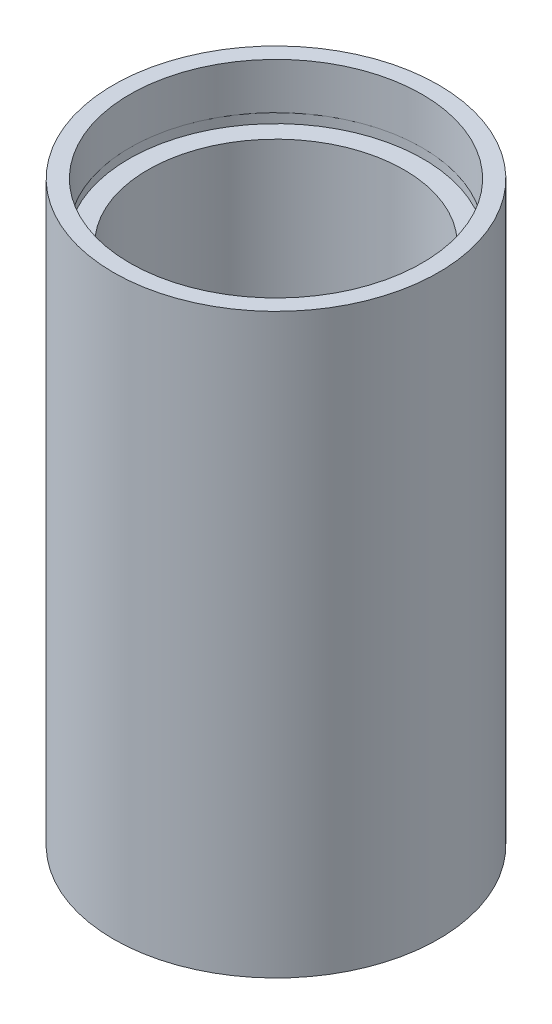
ISO-10303-21;
HEADER;
FILE_DESCRIPTION(('STEP AP214'),'2;1');
FILE_NAME('part.step','',(''),(''),'','','');
FILE_SCHEMA(('AUTOMOTIVE_DESIGN { 1 0 10303 214 1 1 1 1 }'));
ENDSEC;
DATA;
#1=APPLICATION_CONTEXT('core data for automotive mechanical design processes');
#2=APPLICATION_PROTOCOL_DEFINITION('international standard','automotive_design',2000,#1);
#3=PRODUCT_CONTEXT('',#1,'mechanical');
#4=PRODUCT('Part','Part','',(#3));
#5=PRODUCT_RELATED_PRODUCT_CATEGORY('part','',(#4));
#6=PRODUCT_DEFINITION_FORMATION('','',#4);
#7=PRODUCT_DEFINITION_CONTEXT('part definition',#1,'design');
#8=PRODUCT_DEFINITION('design','',#6,#7);
#9=PRODUCT_DEFINITION_SHAPE('','',#8);
#10=(LENGTH_UNIT() NAMED_UNIT(*) SI_UNIT(.MILLI.,.METRE.));
#11=(NAMED_UNIT(*) PLANE_ANGLE_UNIT() SI_UNIT($,.RADIAN.));
#12=(NAMED_UNIT(*) SI_UNIT($,.STERADIAN.) SOLID_ANGLE_UNIT());
#13=UNCERTAINTY_MEASURE_WITH_UNIT(LENGTH_MEASURE(1.E-05),#10,'distance_accuracy_value','');
#14=(GEOMETRIC_REPRESENTATION_CONTEXT(3) GLOBAL_UNCERTAINTY_ASSIGNED_CONTEXT((#13)) GLOBAL_UNIT_ASSIGNED_CONTEXT((#10,
#11,#12)) REPRESENTATION_CONTEXT('',''));
#15=CARTESIAN_POINT('',(0.,0.,0.));
#16=DIRECTION('',(0.,0.,1.));
#17=DIRECTION('',(1.,0.,0.));
#18=AXIS2_PLACEMENT_3D('',#15,#16,#17);
#19=CARTESIAN_POINT('',(13.75,0.,0.));
#20=DIRECTION('',(0.,1.,0.));
#21=DIRECTION('',(0.,0.,1.));
#22=AXIS2_PLACEMENT_3D('',#19,#20,#21);
#23=PLANE('',#22);
#24=CARTESIAN_POINT('',(0.,0.,0.));
#25=DIRECTION('',(0.,1.,0.));
#26=DIRECTION('',(0.,0.,1.));
#27=AXIS2_PLACEMENT_3D('',#24,#25,#26);
#28=CIRCLE('',#27,15.85);
#29=CARTESIAN_POINT('',(0.,0.,15.85));
#30=VERTEX_POINT('',#29);
#31=EDGE_CURVE('E10',#30,#30,#28,.T.);
#32=ORIENTED_EDGE('',*,*,#31,.F.);
#33=EDGE_LOOP('',(#32));
#34=FACE_BOUND('',#33,.T.);
#35=CARTESIAN_POINT('',(0.,0.,0.));
#36=DIRECTION('',(0.,1.,0.));
#37=DIRECTION('',(0.,0.,1.));
#38=AXIS2_PLACEMENT_3D('',#35,#36,#37);
#39=CIRCLE('',#38,13.75);
#40=CARTESIAN_POINT('',(0.,0.,13.75));
#41=VERTEX_POINT('',#40);
#42=EDGE_CURVE('E77',#41,#41,#39,.T.);
#43=ORIENTED_EDGE('',*,*,#42,.T.);
#44=EDGE_LOOP('',(#43));
#45=FACE_BOUND('',#44,.T.);
#46=ADVANCED_FACE('F37',(#34,#45),#23,.F.);
#47=CARTESIAN_POINT('',(0.,161.376166943427,0.));
#48=DIRECTION('',(0.,1.,0.));
#49=DIRECTION('',(0.,0.,1.));
#50=AXIS2_PLACEMENT_3D('',#47,#48,#49);
#51=CYLINDRICAL_SURFACE('',#50,15.85);
#52=CARTESIAN_POINT('',(0.,56.3,0.));
#53=DIRECTION('',(0.,1.,0.));
#54=DIRECTION('',(0.,0.,1.));
#55=AXIS2_PLACEMENT_3D('',#52,#53,#54);
#56=CIRCLE('',#55,15.85);
#57=CARTESIAN_POINT('',(0.,56.3,15.85));
#58=VERTEX_POINT('',#57);
#59=EDGE_CURVE('E43',#58,#58,#56,.T.);
#60=ORIENTED_EDGE('',*,*,#59,.F.);
#61=EDGE_LOOP('',(#60));
#62=FACE_BOUND('',#61,.T.);
#63=ORIENTED_EDGE('',*,*,#31,.T.);
#64=EDGE_LOOP('',(#63));
#65=FACE_BOUND('',#64,.T.);
#66=ADVANCED_FACE('F138',(#62,#65),#51,.T.);
#67=CARTESIAN_POINT('',(15.85,56.3,0.));
#68=DIRECTION('',(0.,-1.,0.));
#69=DIRECTION('',(0.,0.,-1.));
#70=AXIS2_PLACEMENT_3D('',#67,#68,#69);
#71=PLANE('',#70);
#72=CARTESIAN_POINT('',(0.,56.3,0.));
#73=DIRECTION('',(0.,1.,0.));
#74=DIRECTION('',(0.,0.,1.));
#75=AXIS2_PLACEMENT_3D('',#72,#73,#74);
#76=CIRCLE('',#75,14.25);
#77=CARTESIAN_POINT('',(0.,56.3,14.25));
#78=VERTEX_POINT('',#77);
#79=EDGE_CURVE('E47',#78,#78,#76,.T.);
#80=ORIENTED_EDGE('',*,*,#79,.F.);
#81=EDGE_LOOP('',(#80));
#82=FACE_BOUND('',#81,.T.);
#83=ORIENTED_EDGE('',*,*,#59,.T.);
#84=EDGE_LOOP('',(#83));
#85=FACE_BOUND('',#84,.T.);
#86=ADVANCED_FACE('F133',(#82,#85),#71,.F.);
#87=CARTESIAN_POINT('',(0.,161.376166943427,0.));
#88=DIRECTION('',(0.,1.,0.));
#89=DIRECTION('',(0.,0.,1.));
#90=AXIS2_PLACEMENT_3D('',#87,#88,#89);
#91=CYLINDRICAL_SURFACE('',#90,14.25);
#92=CARTESIAN_POINT('',(0.,51.8,0.));
#93=DIRECTION('',(0.,1.,0.));
#94=DIRECTION('',(0.,0.,1.));
#95=AXIS2_PLACEMENT_3D('',#92,#93,#94);
#96=CIRCLE('',#95,14.25);
#97=CARTESIAN_POINT('',(0.,51.8,14.25));
#98=VERTEX_POINT('',#97);
#99=EDGE_CURVE('E51',#98,#98,#96,.T.);
#100=ORIENTED_EDGE('',*,*,#99,.F.);
#101=EDGE_LOOP('',(#100));
#102=FACE_BOUND('',#101,.T.);
#103=ORIENTED_EDGE('',*,*,#79,.T.);
#104=EDGE_LOOP('',(#103));
#105=FACE_BOUND('',#104,.T.);
#106=ADVANCED_FACE('F127',(#102,#105),#91,.F.);
#107=CARTESIAN_POINT('',(14.25,51.8,0.));
#108=DIRECTION('',(0.,1.,0.));
#109=DIRECTION('',(0.,0.,1.));
#110=AXIS2_PLACEMENT_3D('',#107,#108,#109);
#111=PLANE('',#110);
#112=CARTESIAN_POINT('',(0.,51.8,0.));
#113=DIRECTION('',(0.,1.,0.));
#114=DIRECTION('',(0.,0.,1.));
#115=AXIS2_PLACEMENT_3D('',#112,#113,#114);
#116=CIRCLE('',#115,14.35);
#117=CARTESIAN_POINT('',(0.,51.8,14.35));
#118=VERTEX_POINT('',#117);
#119=EDGE_CURVE('E56',#118,#118,#116,.T.);
#120=ORIENTED_EDGE('',*,*,#119,.F.);
#121=EDGE_LOOP('',(#120));
#122=FACE_BOUND('',#121,.T.);
#123=ORIENTED_EDGE('',*,*,#99,.T.);
#124=EDGE_LOOP('',(#123));
#125=FACE_BOUND('',#124,.T.);
#126=ADVANCED_FACE('F121',(#122,#125),#111,.F.);
#127=CARTESIAN_POINT('',(0.,161.376166943427,0.));
#128=DIRECTION('',(0.,1.,0.));
#129=DIRECTION('',(0.,0.,1.));
#130=AXIS2_PLACEMENT_3D('',#127,#128,#129);
#131=CYLINDRICAL_SURFACE('',#130,14.35);
#132=CARTESIAN_POINT('',(0.,50.8,0.));
#133=DIRECTION('',(0.,1.,0.));
#134=DIRECTION('',(0.,0.,1.));
#135=AXIS2_PLACEMENT_3D('',#132,#133,#134);
#136=CIRCLE('',#135,14.35);
#137=CARTESIAN_POINT('',(0.,50.8,14.35));
#138=VERTEX_POINT('',#137);
#139=EDGE_CURVE('E59',#138,#138,#136,.T.);
#140=ORIENTED_EDGE('',*,*,#139,.F.);
#141=EDGE_LOOP('',(#140));
#142=FACE_BOUND('',#141,.T.);
#143=ORIENTED_EDGE('',*,*,#119,.T.);
#144=EDGE_LOOP('',(#143));
#145=FACE_BOUND('',#144,.T.);
#146=ADVANCED_FACE('F115',(#142,#145),#131,.F.);
#147=CARTESIAN_POINT('',(12.5,50.8,0.));
#148=DIRECTION('',(0.,-1.,0.));
#149=DIRECTION('',(0.,0.,-1.));
#150=AXIS2_PLACEMENT_3D('',#147,#148,#149);
#151=PLANE('',#150);
#152=CARTESIAN_POINT('',(0.,50.8,0.));
#153=DIRECTION('',(0.,1.,0.));
#154=DIRECTION('',(0.,0.,1.));
#155=AXIS2_PLACEMENT_3D('',#152,#153,#154);
#156=CIRCLE('',#155,12.5);
#157=CARTESIAN_POINT('',(0.,50.8,12.5));
#158=VERTEX_POINT('',#157);
#159=EDGE_CURVE('E62',#158,#158,#156,.T.);
#160=ORIENTED_EDGE('',*,*,#159,.F.);
#161=EDGE_LOOP('',(#160));
#162=FACE_BOUND('',#161,.T.);
#163=ORIENTED_EDGE('',*,*,#139,.T.);
#164=EDGE_LOOP('',(#163));
#165=FACE_BOUND('',#164,.T.);
#166=ADVANCED_FACE('F109',(#162,#165),#151,.F.);
#167=CARTESIAN_POINT('',(0.,161.376166943427,0.));
#168=DIRECTION('',(0.,1.,0.));
#169=DIRECTION('',(0.,0.,1.));
#170=AXIS2_PLACEMENT_3D('',#167,#168,#169);
#171=CYLINDRICAL_SURFACE('',#170,12.5);
#172=CARTESIAN_POINT('',(0.,5.49999999999998,0.));
#173=DIRECTION('',(0.,1.,0.));
#174=DIRECTION('',(0.,0.,1.));
#175=AXIS2_PLACEMENT_3D('',#172,#173,#174);
#176=CIRCLE('',#175,12.5);
#177=CARTESIAN_POINT('',(0.,5.49999999999998,12.5));
#178=VERTEX_POINT('',#177);
#179=EDGE_CURVE('E65',#178,#178,#176,.T.);
#180=ORIENTED_EDGE('',*,*,#179,.F.);
#181=EDGE_LOOP('',(#180));
#182=FACE_BOUND('',#181,.T.);
#183=ORIENTED_EDGE('',*,*,#159,.T.);
#184=EDGE_LOOP('',(#183));
#185=FACE_BOUND('',#184,.T.);
#186=ADVANCED_FACE('F103',(#182,#185),#171,.F.);
#187=CARTESIAN_POINT('',(12.5,5.49999999999998,0.));
#188=DIRECTION('',(0.,1.,0.));
#189=DIRECTION('',(0.,0.,1.));
#190=AXIS2_PLACEMENT_3D('',#187,#188,#189);
#191=PLANE('',#190);
#192=CARTESIAN_POINT('',(0.,5.49999999999998,0.));
#193=DIRECTION('',(0.,1.,0.));
#194=DIRECTION('',(0.,0.,1.));
#195=AXIS2_PLACEMENT_3D('',#192,#193,#194);
#196=CIRCLE('',#195,14.35);
#197=CARTESIAN_POINT('',(0.,5.49999999999998,14.35));
#198=VERTEX_POINT('',#197);
#199=EDGE_CURVE('E68',#198,#198,#196,.T.);
#200=ORIENTED_EDGE('',*,*,#199,.F.);
#201=EDGE_LOOP('',(#200));
#202=FACE_BOUND('',#201,.T.);
#203=ORIENTED_EDGE('',*,*,#179,.T.);
#204=EDGE_LOOP('',(#203));
#205=FACE_BOUND('',#204,.T.);
#206=ADVANCED_FACE('F97',(#202,#205),#191,.F.);
#207=CARTESIAN_POINT('',(0.,161.376166943427,0.));
#208=DIRECTION('',(0.,1.,0.));
#209=DIRECTION('',(0.,0.,1.));
#210=AXIS2_PLACEMENT_3D('',#207,#208,#209);
#211=CYLINDRICAL_SURFACE('',#210,14.35);
#212=CARTESIAN_POINT('',(0.,4.49999999999998,0.));
#213=DIRECTION('',(0.,1.,0.));
#214=DIRECTION('',(0.,0.,1.));
#215=AXIS2_PLACEMENT_3D('',#212,#213,#214);
#216=CIRCLE('',#215,14.35);
#217=CARTESIAN_POINT('',(0.,4.49999999999998,14.35));
#218=VERTEX_POINT('',#217);
#219=EDGE_CURVE('E71',#218,#218,#216,.T.);
#220=ORIENTED_EDGE('',*,*,#219,.F.);
#221=EDGE_LOOP('',(#220));
#222=FACE_BOUND('',#221,.T.);
#223=ORIENTED_EDGE('',*,*,#199,.T.);
#224=EDGE_LOOP('',(#223));
#225=FACE_BOUND('',#224,.T.);
#226=ADVANCED_FACE('F91',(#222,#225),#211,.F.);
#227=CARTESIAN_POINT('',(13.75,4.49999999999998,0.));
#228=DIRECTION('',(0.,-1.,0.));
#229=DIRECTION('',(0.,0.,-1.));
#230=AXIS2_PLACEMENT_3D('',#227,#228,#229);
#231=PLANE('',#230);
#232=CARTESIAN_POINT('',(0.,4.49999999999998,0.));
#233=DIRECTION('',(0.,1.,0.));
#234=DIRECTION('',(0.,0.,1.));
#235=AXIS2_PLACEMENT_3D('',#232,#233,#234);
#236=CIRCLE('',#235,13.75);
#237=CARTESIAN_POINT('',(0.,4.49999999999998,13.75));
#238=VERTEX_POINT('',#237);
#239=EDGE_CURVE('E74',#238,#238,#236,.T.);
#240=ORIENTED_EDGE('',*,*,#239,.F.);
#241=EDGE_LOOP('',(#240));
#242=FACE_BOUND('',#241,.T.);
#243=ORIENTED_EDGE('',*,*,#219,.T.);
#244=EDGE_LOOP('',(#243));
#245=FACE_BOUND('',#244,.T.);
#246=ADVANCED_FACE('F85',(#242,#245),#231,.F.);
#247=CARTESIAN_POINT('',(0.,161.376166943427,0.));
#248=DIRECTION('',(0.,1.,0.));
#249=DIRECTION('',(0.,0.,1.));
#250=AXIS2_PLACEMENT_3D('',#247,#248,#249);
#251=CYLINDRICAL_SURFACE('',#250,13.75);
#252=ORIENTED_EDGE('',*,*,#42,.F.);
#253=EDGE_LOOP('',(#252));
#254=FACE_BOUND('',#253,.T.);
#255=ORIENTED_EDGE('',*,*,#239,.T.);
#256=EDGE_LOOP('',(#255));
#257=FACE_BOUND('',#256,.T.);
#258=ADVANCED_FACE('F82',(#254,#257),#251,.F.);
#259=CLOSED_SHELL('',(#46,#66,#86,#106,#126,#146,#166,#186,#206,#226,#246,#258));
#260=MANIFOLD_SOLID_BREP('B2',#259);
#261=ADVANCED_BREP_SHAPE_REPRESENTATION('',(#18,#260),#14);
#262=SHAPE_DEFINITION_REPRESENTATION(#9,#261);
ENDSEC;
END-ISO-10303-21;
